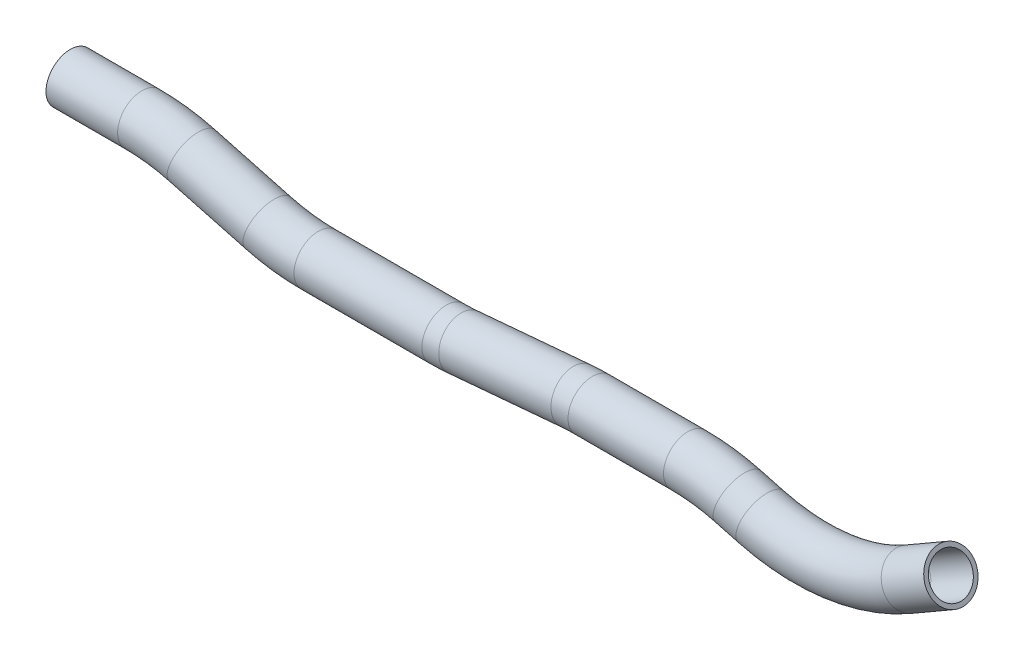
ISO-10303-21;
HEADER;
FILE_DESCRIPTION(('STEP AP214'),'2;1');
FILE_NAME('part.step','',(''),(''),'','','');
FILE_SCHEMA(('AUTOMOTIVE_DESIGN { 1 0 10303 214 1 1 1 1 }'));
ENDSEC;
DATA;
#1=APPLICATION_CONTEXT('core data for automotive mechanical design processes');
#2=APPLICATION_PROTOCOL_DEFINITION('international standard','automotive_design',2000,#1);
#3=PRODUCT_CONTEXT('',#1,'mechanical');
#4=PRODUCT('Part','Part','',(#3));
#5=PRODUCT_RELATED_PRODUCT_CATEGORY('part','',(#4));
#6=PRODUCT_DEFINITION_FORMATION('','',#4);
#7=PRODUCT_DEFINITION_CONTEXT('part definition',#1,'design');
#8=PRODUCT_DEFINITION('design','',#6,#7);
#9=PRODUCT_DEFINITION_SHAPE('','',#8);
#10=(LENGTH_UNIT() NAMED_UNIT(*) SI_UNIT(.MILLI.,.METRE.));
#11=(NAMED_UNIT(*) PLANE_ANGLE_UNIT() SI_UNIT($,.RADIAN.));
#12=(NAMED_UNIT(*) SI_UNIT($,.STERADIAN.) SOLID_ANGLE_UNIT());
#13=UNCERTAINTY_MEASURE_WITH_UNIT(LENGTH_MEASURE(1.E-05),#10,'distance_accuracy_value','');
#14=(GEOMETRIC_REPRESENTATION_CONTEXT(3) GLOBAL_UNCERTAINTY_ASSIGNED_CONTEXT((#13)) GLOBAL_UNIT_ASSIGNED_CONTEXT((#10,
#11,#12)) REPRESENTATION_CONTEXT('',''));
#15=CARTESIAN_POINT('',(0.,0.,0.));
#16=DIRECTION('',(0.,0.,1.));
#17=DIRECTION('',(1.,0.,0.));
#18=AXIS2_PLACEMENT_3D('',#15,#16,#17);
#19=CARTESIAN_POINT('',(124.181687084773,-15.9493236059186,0.));
#20=DIRECTION('',(1.,0.,0.));
#21=DIRECTION('',(0.,1.,0.));
#22=AXIS2_PLACEMENT_3D('',#19,#20,#21);
#23=CYLINDRICAL_SURFACE('',#22,9.525);
#24=CARTESIAN_POINT('',(152.249766768613,-15.9493236059186,0.));
#25=DIRECTION('',(1.,0.,0.));
#26=DIRECTION('',(0.,1.,0.));
#27=AXIS2_PLACEMENT_3D('',#24,#25,#26);
#28=CIRCLE('',#27,9.525);
#29=CARTESIAN_POINT('',(152.249766768613,-6.4243236059186,0.));
#30=VERTEX_POINT('',#29);
#31=EDGE_CURVE('E65',#30,#30,#28,.T.);
#32=ORIENTED_EDGE('',*,*,#31,.F.);
#33=EDGE_LOOP('',(#32));
#34=FACE_BOUND('',#33,.T.);
#35=CARTESIAN_POINT('',(124.181687084773,-15.9493236059186,0.));
#36=DIRECTION('',(1.,0.,0.));
#37=DIRECTION('',(0.,1.,0.));
#38=AXIS2_PLACEMENT_3D('',#35,#36,#37);
#39=CIRCLE('',#38,9.525);
#40=CARTESIAN_POINT('',(124.181687084773,-6.42432360591861,0.));
#41=VERTEX_POINT('',#40);
#42=EDGE_CURVE('E61',#41,#41,#39,.T.);
#43=ORIENTED_EDGE('',*,*,#42,.T.);
#44=EDGE_LOOP('',(#43));
#45=FACE_BOUND('',#44,.T.);
#46=ADVANCED_FACE('F37',(#34,#45),#23,.T.);
#47=CARTESIAN_POINT('',(152.249766768613,-92.1493236059186,0.));
#48=DIRECTION('',(0.,0.,-1.));
#49=DIRECTION('',(-1.,0.,0.));
#50=AXIS2_PLACEMENT_3D('',#47,#48,#49);
#51=TOROIDAL_SURFACE('',#50,76.2,9.525);
#52=CARTESIAN_POINT('',(171.971778005425,-18.5457756426916,0.));
#53=DIRECTION('',(0.965925826289068,-0.258819045102521,0.));
#54=DIRECTION('',(0.258819045102521,0.965925826289068,0.));
#55=AXIS2_PLACEMENT_3D('',#52,#53,#54);
#56=CIRCLE('',#55,9.525);
#57=CARTESIAN_POINT('',(174.437029410027,-9.34533214728822,0.));
#58=VERTEX_POINT('',#57);
#59=EDGE_CURVE('E69',#58,#58,#56,.T.);
#60=CARTESIAN_POINT('',(152.249766768613,-92.1493236059186,0.));
#61=DIRECTION('',(0.,0.,-1.));
#62=DIRECTION('',(-1.,0.,0.));
#63=AXIS2_PLACEMENT_3D('',#60,#61,#62);
#64=CIRCLE('',#63,85.725);
#65=EDGE_CURVE('',#30,#58,#64,.T.);
#66=ORIENTED_EDGE('',*,*,#31,.T.);
#67=ORIENTED_EDGE('',*,*,#59,.F.);
#68=ORIENTED_EDGE('',*,*,#65,.T.);
#69=ORIENTED_EDGE('',*,*,#65,.F.);
#70=EDGE_LOOP('',(#66,#68,#67,#69));
#71=FACE_BOUND('',#70,.T.);
#72=ADVANCED_FACE('F149',(#71),#51,.T.);
#73=CARTESIAN_POINT('',(171.971778005425,-18.5457756426916,0.));
#74=DIRECTION('',(0.965925826289068,-0.258819045102521,0.));
#75=DIRECTION('',(0.258819045102521,0.965925826289068,0.));
#76=AXIS2_PLACEMENT_3D('',#73,#74,#75);
#77=CYLINDRICAL_SURFACE('',#76,9.525);
#78=CARTESIAN_POINT('',(201.660628139605,-26.5008790603537,0.));
#79=DIRECTION('',(0.965925826289068,-0.258819045102521,0.));
#80=DIRECTION('',(0.258819045102521,0.965925826289068,0.));
#81=AXIS2_PLACEMENT_3D('',#78,#79,#80);
#82=CIRCLE('',#81,9.525);
#83=CARTESIAN_POINT('',(199.195376735003,-35.7013225557571,0.));
#84=VERTEX_POINT('',#83);
#85=EDGE_CURVE('E73',#84,#84,#82,.T.);
#86=ORIENTED_EDGE('',*,*,#85,.F.);
#87=EDGE_LOOP('',(#86));
#88=FACE_BOUND('',#87,.T.);
#89=ORIENTED_EDGE('',*,*,#59,.T.);
#90=EDGE_LOOP('',(#89));
#91=FACE_BOUND('',#90,.T.);
#92=ADVANCED_FACE('F153',(#88,#91),#77,.T.);
#93=CARTESIAN_POINT('',(221.382639376417,47.1026689028733,0.));
#94=DIRECTION('',(0.,0.,1.));
#95=DIRECTION('',(1.,0.,0.));
#96=AXIS2_PLACEMENT_3D('',#93,#94,#95);
#97=TOROIDAL_SURFACE('',#96,76.2,9.525);
#98=CARTESIAN_POINT('',(221.382639376417,-29.0973310971267,0.));
#99=DIRECTION('',(1.,0.,0.));
#100=DIRECTION('',(0.,1.,0.));
#101=AXIS2_PLACEMENT_3D('',#98,#99,#100);
#102=CIRCLE('',#101,9.525);
#103=CARTESIAN_POINT('',(221.382639376417,-38.6223310971267,0.));
#104=VERTEX_POINT('',#103);
#105=EDGE_CURVE('E77',#104,#104,#102,.T.);
#106=CARTESIAN_POINT('',(221.382639376417,47.1026689028733,0.));
#107=DIRECTION('',(0.,0.,1.));
#108=DIRECTION('',(1.,0.,0.));
#109=AXIS2_PLACEMENT_3D('',#106,#107,#108);
#110=CIRCLE('',#109,85.725);
#111=EDGE_CURVE('',#84,#104,#110,.T.);
#112=ORIENTED_EDGE('',*,*,#85,.T.);
#113=ORIENTED_EDGE('',*,*,#105,.F.);
#114=ORIENTED_EDGE('',*,*,#111,.T.);
#115=ORIENTED_EDGE('',*,*,#111,.F.);
#116=EDGE_LOOP('',(#112,#114,#113,#115));
#117=FACE_BOUND('',#116,.T.);
#118=ADVANCED_FACE('F157',(#117),#97,.T.);
#119=CARTESIAN_POINT('',(221.382639376417,-29.0973310971265,0.));
#120=DIRECTION('',(1.,0.,0.));
#121=DIRECTION('',(0.,1.,0.));
#122=AXIS2_PLACEMENT_3D('',#119,#120,#121);
#123=CYLINDRICAL_SURFACE('',#122,9.525);
#124=CARTESIAN_POINT('',(271.523755210629,-29.0973310971266,0.));
#125=DIRECTION('',(1.,0.,0.));
#126=DIRECTION('',(0.,1.,0.));
#127=AXIS2_PLACEMENT_3D('',#124,#125,#126);
#128=CIRCLE('',#127,9.525);
#129=CARTESIAN_POINT('',(271.523755210629,-38.6223310971268,0.));
#130=VERTEX_POINT('',#129);
#131=EDGE_CURVE('E81',#130,#130,#128,.T.);
#132=ORIENTED_EDGE('',*,*,#131,.F.);
#133=EDGE_LOOP('',(#132));
#134=FACE_BOUND('',#133,.T.);
#135=ORIENTED_EDGE('',*,*,#105,.T.);
#136=EDGE_LOOP('',(#135));
#137=FACE_BOUND('',#136,.T.);
#138=ADVANCED_FACE('F161',(#134,#137),#123,.T.);
#139=CARTESIAN_POINT('',(271.523755210629,47.1026689028733,0.));
#140=DIRECTION('',(0.,0.,1.));
#141=DIRECTION('',(1.,0.,0.));
#142=AXIS2_PLACEMENT_3D('',#139,#140,#141);
#143=TOROIDAL_SURFACE('',#142,76.2000000000001,9.525);
#144=CARTESIAN_POINT('',(278.165022808,-28.8073670917177,0.));
#145=DIRECTION('',(0.996194698091745,0.0871557427476593,0.));
#146=DIRECTION('',(-0.0871557427476593,0.996194698091745,0.));
#147=AXIS2_PLACEMENT_3D('',#144,#145,#146);
#148=CIRCLE('',#147,9.525);
#149=CARTESIAN_POINT('',(278.995181257672,-38.2961215910417,0.));
#150=VERTEX_POINT('',#149);
#151=EDGE_CURVE('E85',#150,#150,#148,.T.);
#152=CARTESIAN_POINT('',(271.523755210629,47.1026689028733,0.));
#153=DIRECTION('',(0.,0.,1.));
#154=DIRECTION('',(1.,0.,0.));
#155=AXIS2_PLACEMENT_3D('',#152,#153,#154);
#156=CIRCLE('',#155,85.7250000000001);
#157=EDGE_CURVE('',#130,#150,#156,.T.);
#158=ORIENTED_EDGE('',*,*,#131,.T.);
#159=ORIENTED_EDGE('',*,*,#151,.F.);
#160=ORIENTED_EDGE('',*,*,#157,.T.);
#161=ORIENTED_EDGE('',*,*,#157,.F.);
#162=EDGE_LOOP('',(#158,#160,#159,#161));
#163=FACE_BOUND('',#162,.T.);
#164=ADVANCED_FACE('F165',(#163),#143,.T.);
#165=CARTESIAN_POINT('',(278.165022808,-28.8073670917177,0.));
#166=DIRECTION('',(0.996194698091745,0.0871557427476594,0.));
#167=DIRECTION('',(-0.0871557427476594,0.996194698091746,0.));
#168=AXIS2_PLACEMENT_3D('',#165,#166,#167);
#169=CYLINDRICAL_SURFACE('',#168,9.525);
#170=CARTESIAN_POINT('',(322.143105975575,-24.9597833709546,0.));
#171=DIRECTION('',(0.996194698091745,0.0871557427476592,0.));
#172=DIRECTION('',(-0.0871557427476592,0.996194698091745,0.));
#173=AXIS2_PLACEMENT_3D('',#170,#171,#172);
#174=CIRCLE('',#173,9.525);
#175=CARTESIAN_POINT('',(321.312947525904,-15.4710288716307,0.));
#176=VERTEX_POINT('',#175);
#177=EDGE_CURVE('E89',#176,#176,#174,.T.);
#178=ORIENTED_EDGE('',*,*,#177,.F.);
#179=EDGE_LOOP('',(#178));
#180=FACE_BOUND('',#179,.T.);
#181=ORIENTED_EDGE('',*,*,#151,.T.);
#182=EDGE_LOOP('',(#181));
#183=FACE_BOUND('',#182,.T.);
#184=ADVANCED_FACE('F169',(#180,#183),#169,.T.);
#185=CARTESIAN_POINT('',(328.784373572947,-100.869819365546,0.));
#186=DIRECTION('',(0.,0.,-1.));
#187=DIRECTION('',(-1.,0.,0.));
#188=AXIS2_PLACEMENT_3D('',#185,#186,#187);
#189=TOROIDAL_SURFACE('',#188,76.2,9.525);
#190=CARTESIAN_POINT('',(328.784373572947,-24.6698193655458,0.));
#191=DIRECTION('',(1.,0.,0.));
#192=DIRECTION('',(0.,1.,0.));
#193=AXIS2_PLACEMENT_3D('',#190,#191,#192);
#194=CIRCLE('',#193,9.525);
#195=CARTESIAN_POINT('',(328.784373572947,-15.1448193655456,0.));
#196=VERTEX_POINT('',#195);
#197=EDGE_CURVE('E93',#196,#196,#194,.T.);
#198=CARTESIAN_POINT('',(328.784373572947,-100.869819365546,0.));
#199=DIRECTION('',(0.,0.,-1.));
#200=DIRECTION('',(-1.,0.,0.));
#201=AXIS2_PLACEMENT_3D('',#198,#199,#200);
#202=CIRCLE('',#201,85.725);
#203=EDGE_CURVE('',#176,#196,#202,.T.);
#204=ORIENTED_EDGE('',*,*,#177,.T.);
#205=ORIENTED_EDGE('',*,*,#197,.F.);
#206=ORIENTED_EDGE('',*,*,#203,.T.);
#207=ORIENTED_EDGE('',*,*,#203,.F.);
#208=EDGE_LOOP('',(#204,#206,#205,#207));
#209=FACE_BOUND('',#208,.T.);
#210=ADVANCED_FACE('F173',(#209),#189,.T.);
#211=CARTESIAN_POINT('',(328.784373572947,-24.6698193655458,0.));
#212=DIRECTION('',(1.,0.,0.));
#213=DIRECTION('',(0.,1.,0.));
#214=AXIS2_PLACEMENT_3D('',#211,#212,#213);
#215=CYLINDRICAL_SURFACE('',#214,9.525);
#216=CARTESIAN_POINT('',(366.225489407159,-24.6698193655457,0.));
#217=DIRECTION('',(1.,0.,0.));
#218=DIRECTION('',(0.,1.,0.));
#219=AXIS2_PLACEMENT_3D('',#216,#217,#218);
#220=CIRCLE('',#219,9.525);
#221=CARTESIAN_POINT('',(366.225489407159,-15.1448193655452,0.));
#222=VERTEX_POINT('',#221);
#223=EDGE_CURVE('E97',#222,#222,#220,.T.);
#224=ORIENTED_EDGE('',*,*,#223,.F.);
#225=EDGE_LOOP('',(#224));
#226=FACE_BOUND('',#225,.T.);
#227=ORIENTED_EDGE('',*,*,#197,.T.);
#228=EDGE_LOOP('',(#227));
#229=FACE_BOUND('',#228,.T.);
#230=ADVANCED_FACE('F177',(#226,#229),#215,.T.);
#231=CARTESIAN_POINT('',(366.225489407159,-100.869819365545,0.));
#232=DIRECTION('',(0.,0.,-1.));
#233=DIRECTION('',(-1.,0.,0.));
#234=AXIS2_PLACEMENT_3D('',#231,#232,#233);
#235=TOROIDAL_SURFACE('',#234,76.2000000000001,9.525);
#236=CARTESIAN_POINT('',(385.947500643971,-27.2662714023186,0.));
#237=DIRECTION('',(0.965925826289067,-0.258819045102524,0.));
#238=DIRECTION('',(0.258819045102524,0.965925826289068,0.));
#239=AXIS2_PLACEMENT_3D('',#236,#237,#238);
#240=CIRCLE('',#239,9.525);
#241=CARTESIAN_POINT('',(388.412752048572,-18.0658279069149,0.));
#242=VERTEX_POINT('',#241);
#243=EDGE_CURVE('E101',#242,#242,#240,.T.);
#244=CARTESIAN_POINT('',(366.225489407159,-100.869819365545,0.));
#245=DIRECTION('',(0.,0.,-1.));
#246=DIRECTION('',(-1.,0.,0.));
#247=AXIS2_PLACEMENT_3D('',#244,#245,#246);
#248=CIRCLE('',#247,85.7250000000002);
#249=EDGE_CURVE('',#222,#242,#248,.T.);
#250=ORIENTED_EDGE('',*,*,#223,.T.);
#251=ORIENTED_EDGE('',*,*,#243,.F.);
#252=ORIENTED_EDGE('',*,*,#249,.T.);
#253=ORIENTED_EDGE('',*,*,#249,.F.);
#254=EDGE_LOOP('',(#250,#252,#251,#253));
#255=FACE_BOUND('',#254,.T.);
#256=ADVANCED_FACE('F123',(#255),#235,.T.);
#257=CARTESIAN_POINT('',(385.947500643971,-27.2662714023185,0.));
#258=DIRECTION('',(0.965925826289067,-0.258819045102527,0.));
#259=DIRECTION('',(0.258819045102527,0.965925826289067,0.));
#260=AXIS2_PLACEMENT_3D('',#257,#258,#259);
#261=CYLINDRICAL_SURFACE('',#260,9.525);
#262=CARTESIAN_POINT('',(394.838853893655,-29.6487023251914,0.));
#263=DIRECTION('',(0.965925826289067,-0.258819045102527,0.));
#264=DIRECTION('',(0.258819045102527,0.965925826289067,0.));
#265=AXIS2_PLACEMENT_3D('',#262,#263,#264);
#266=CIRCLE('',#265,9.525);
#267=CARTESIAN_POINT('',(392.373602489054,-38.8491458205948,0.));
#268=VERTEX_POINT('',#267);
#269=EDGE_CURVE('E104',#268,#268,#266,.T.);
#270=ORIENTED_EDGE('',*,*,#269,.F.);
#271=EDGE_LOOP('',(#270));
#272=FACE_BOUND('',#271,.T.);
#273=ORIENTED_EDGE('',*,*,#243,.T.);
#274=EDGE_LOOP('',(#273));
#275=FACE_BOUND('',#274,.T.);
#276=ADVANCED_FACE('F116',(#272,#275),#261,.T.);
#277=CARTESIAN_POINT('',(414.560865130467,43.9548456380357,0.));
#278=DIRECTION('',(0.,0.,1.));
#279=DIRECTION('',(1.,0.,0.));
#280=AXIS2_PLACEMENT_3D('',#277,#278,#279);
#281=TOROIDAL_SURFACE('',#280,76.2000000000001,9.525);
#282=CARTESIAN_POINT('',(452.660865130468,-22.0362901303385,0.));
#283=DIRECTION('',(0.866025403784437,0.500000000000002,0.));
#284=DIRECTION('',(-0.500000000000002,0.866025403784437,0.));
#285=AXIS2_PLACEMENT_3D('',#282,#283,#284);
#286=CIRCLE('',#285,9.525);
#287=CARTESIAN_POINT('',(457.423365130468,-30.2851821013852,0.));
#288=VERTEX_POINT('',#287);
#289=EDGE_CURVE('E41',#288,#288,#286,.T.);
#290=CARTESIAN_POINT('',(414.560865130467,43.9548456380357,0.));
#291=DIRECTION('',(0.,0.,1.));
#292=DIRECTION('',(1.,0.,0.));
#293=AXIS2_PLACEMENT_3D('',#290,#291,#292);
#294=CIRCLE('',#293,85.7250000000001);
#295=EDGE_CURVE('',#268,#288,#294,.T.);
#296=ORIENTED_EDGE('',*,*,#269,.T.);
#297=ORIENTED_EDGE('',*,*,#289,.F.);
#298=ORIENTED_EDGE('',*,*,#295,.T.);
#299=ORIENTED_EDGE('',*,*,#295,.F.);
#300=EDGE_LOOP('',(#296,#298,#297,#299));
#301=FACE_BOUND('',#300,.T.);
#302=ADVANCED_FACE('F114',(#301),#281,.T.);
#303=CARTESIAN_POINT('',(452.660865130468,-22.0362901303384,0.));
#304=DIRECTION('',(0.866025403784437,0.500000000000003,0.));
#305=DIRECTION('',(-0.500000000000003,0.866025403784437,0.));
#306=AXIS2_PLACEMENT_3D('',#303,#304,#305);
#307=CYLINDRICAL_SURFACE('',#306,9.525);
#308=CARTESIAN_POINT('',(469.320532211052,-12.4178268567534,0.));
#309=DIRECTION('',(0.866025403784437,0.500000000000002,0.));
#310=DIRECTION('',(-0.500000000000002,0.866025403784437,0.));
#311=AXIS2_PLACEMENT_3D('',#308,#309,#310);
#312=CIRCLE('',#311,9.525);
#313=CARTESIAN_POINT('',(464.558032211052,-4.16893488570662,0.));
#314=VERTEX_POINT('',#313);
#315=EDGE_CURVE('E56',#314,#314,#312,.T.);
#316=ORIENTED_EDGE('',*,*,#315,.F.);
#317=EDGE_LOOP('',(#316));
#318=FACE_BOUND('',#317,.T.);
#319=ORIENTED_EDGE('',*,*,#289,.T.);
#320=EDGE_LOOP('',(#319));
#321=FACE_BOUND('',#320,.T.);
#322=ADVANCED_FACE('F39',(#318,#321),#307,.T.);
#323=CARTESIAN_POINT('',(124.181687084773,-15.9493236059186,0.));
#324=DIRECTION('',(1.,0.,0.));
#325=DIRECTION('',(0.,1.,0.));
#326=AXIS2_PLACEMENT_3D('',#323,#324,#325);
#327=PLANE('',#326);
#328=CARTESIAN_POINT('',(124.181687084773,-15.9493236059186,0.));
#329=DIRECTION('',(1.,0.,0.));
#330=DIRECTION('',(0.,1.,0.));
#331=AXIS2_PLACEMENT_3D('',#328,#329,#330);
#332=CIRCLE('',#331,7.874);
#333=CARTESIAN_POINT('',(124.181687084773,-8.07532360591861,0.));
#334=VERTEX_POINT('',#333);
#335=EDGE_CURVE('E60',#334,#334,#332,.F.);
#336=ORIENTED_EDGE('',*,*,#335,.F.);
#337=EDGE_LOOP('',(#336));
#338=FACE_BOUND('',#337,.T.);
#339=ORIENTED_EDGE('',*,*,#42,.F.);
#340=EDGE_LOOP('',(#339));
#341=FACE_BOUND('',#340,.T.);
#342=ADVANCED_FACE('F121',(#338,#341),#327,.F.);
#343=CARTESIAN_POINT('',(469.320532211052,-12.4178268567534,0.));
#344=DIRECTION('',(0.866025403784437,0.500000000000002,0.));
#345=DIRECTION('',(-0.500000000000002,0.866025403784437,0.));
#346=AXIS2_PLACEMENT_3D('',#343,#344,#345);
#347=PLANE('',#346);
#348=CARTESIAN_POINT('',(469.320532211052,-12.4178268567534,0.));
#349=DIRECTION('',(0.866025403784437,0.500000000000002,0.));
#350=DIRECTION('',(-0.500000000000002,0.866025403784437,0.));
#351=AXIS2_PLACEMENT_3D('',#348,#349,#350);
#352=CIRCLE('',#351,7.874);
#353=CARTESIAN_POINT('',(465.383532211052,-5.59874282735473,0.));
#354=VERTEX_POINT('',#353);
#355=EDGE_CURVE('E10',#354,#354,#352,.F.);
#356=ORIENTED_EDGE('',*,*,#355,.T.);
#357=EDGE_LOOP('',(#356));
#358=FACE_BOUND('',#357,.T.);
#359=ORIENTED_EDGE('',*,*,#315,.T.);
#360=EDGE_LOOP('',(#359));
#361=FACE_BOUND('',#360,.T.);
#362=ADVANCED_FACE('F140',(#358,#361),#347,.T.);
#363=CARTESIAN_POINT('',(124.181687084773,-15.9493236059186,0.));
#364=DIRECTION('',(1.,0.,0.));
#365=DIRECTION('',(0.,1.,0.));
#366=AXIS2_PLACEMENT_3D('',#363,#364,#365);
#367=CYLINDRICAL_SURFACE('',#366,7.874);
#368=CARTESIAN_POINT('',(152.249766768613,-15.9493236059186,0.));
#369=DIRECTION('',(1.,0.,0.));
#370=DIRECTION('',(0.,1.,0.));
#371=AXIS2_PLACEMENT_3D('',#368,#369,#370);
#372=CIRCLE('',#371,7.874);
#373=CARTESIAN_POINT('',(152.249766768613,-8.07532360591862,0.));
#374=VERTEX_POINT('',#373);
#375=EDGE_CURVE('E400',#374,#374,#372,.F.);
#376=ORIENTED_EDGE('',*,*,#375,.F.);
#377=EDGE_LOOP('',(#376));
#378=FACE_BOUND('',#377,.T.);
#379=ORIENTED_EDGE('',*,*,#335,.T.);
#380=EDGE_LOOP('',(#379));
#381=FACE_BOUND('',#380,.T.);
#382=ADVANCED_FACE('F143',(#378,#381),#367,.F.);
#383=CARTESIAN_POINT('',(152.249766768613,-92.1493236059186,0.));
#384=DIRECTION('',(0.,0.,-1.));
#385=DIRECTION('',(-1.,0.,0.));
#386=AXIS2_PLACEMENT_3D('',#383,#384,#385);
#387=TOROIDAL_SURFACE('',#386,76.2,7.874);
#388=CARTESIAN_POINT('',(171.971778005425,-18.5457756426916,0.));
#389=DIRECTION('',(0.965925826289068,-0.258819045102521,0.));
#390=DIRECTION('',(0.258819045102521,0.965925826289068,0.));
#391=AXIS2_PLACEMENT_3D('',#388,#389,#390);
#392=CIRCLE('',#391,7.874);
#393=CARTESIAN_POINT('',(174.009719166562,-10.9400756864915,0.));
#394=VERTEX_POINT('',#393);
#395=EDGE_CURVE('E396',#394,#394,#392,.F.);
#396=CARTESIAN_POINT('',(152.249766768613,-92.1493236059186,0.));
#397=DIRECTION('',(0.,0.,-1.));
#398=DIRECTION('',(-1.,0.,0.));
#399=AXIS2_PLACEMENT_3D('',#396,#397,#398);
#400=CIRCLE('',#399,84.074);
#401=EDGE_CURVE('',#374,#394,#400,.T.);
#402=ORIENTED_EDGE('',*,*,#375,.T.);
#403=ORIENTED_EDGE('',*,*,#395,.F.);
#404=ORIENTED_EDGE('',*,*,#401,.T.);
#405=ORIENTED_EDGE('',*,*,#401,.F.);
#406=EDGE_LOOP('',(#402,#404,#403,#405));
#407=FACE_BOUND('',#406,.T.);
#408=ADVANCED_FACE('F246',(#407),#387,.F.);
#409=CARTESIAN_POINT('',(171.971778005425,-18.5457756426916,0.));
#410=DIRECTION('',(0.965925826289068,-0.258819045102521,0.));
#411=DIRECTION('',(0.258819045102521,0.965925826289068,0.));
#412=AXIS2_PLACEMENT_3D('',#409,#410,#411);
#413=CYLINDRICAL_SURFACE('',#412,7.874);
#414=CARTESIAN_POINT('',(201.660628139605,-26.5008790603537,0.));
#415=DIRECTION('',(0.965925826289068,-0.258819045102521,0.));
#416=DIRECTION('',(0.258819045102521,0.965925826289068,0.));
#417=AXIS2_PLACEMENT_3D('',#414,#415,#416);
#418=CIRCLE('',#417,7.874);
#419=CARTESIAN_POINT('',(199.622686978468,-34.1065790165538,0.));
#420=VERTEX_POINT('',#419);
#421=EDGE_CURVE('E392',#420,#420,#418,.F.);
#422=ORIENTED_EDGE('',*,*,#421,.F.);
#423=EDGE_LOOP('',(#422));
#424=FACE_BOUND('',#423,.T.);
#425=ORIENTED_EDGE('',*,*,#395,.T.);
#426=EDGE_LOOP('',(#425));
#427=FACE_BOUND('',#426,.T.);
#428=ADVANCED_FACE('F256',(#424,#427),#413,.F.);
#429=CARTESIAN_POINT('',(221.382639376417,47.1026689028733,0.));
#430=DIRECTION('',(0.,0.,1.));
#431=DIRECTION('',(1.,0.,0.));
#432=AXIS2_PLACEMENT_3D('',#429,#430,#431);
#433=TOROIDAL_SURFACE('',#432,76.2,7.874);
#434=CARTESIAN_POINT('',(221.382639376417,-29.0973310971267,0.));
#435=DIRECTION('',(1.,0.,0.));
#436=DIRECTION('',(0.,1.,0.));
#437=AXIS2_PLACEMENT_3D('',#434,#435,#436);
#438=CIRCLE('',#437,7.874);
#439=CARTESIAN_POINT('',(221.382639376417,-36.9713310971267,0.));
#440=VERTEX_POINT('',#439);
#441=EDGE_CURVE('E388',#440,#440,#438,.F.);
#442=CARTESIAN_POINT('',(221.382639376417,47.1026689028733,0.));
#443=DIRECTION('',(0.,0.,1.));
#444=DIRECTION('',(1.,0.,0.));
#445=AXIS2_PLACEMENT_3D('',#442,#443,#444);
#446=CIRCLE('',#445,84.074);
#447=EDGE_CURVE('',#420,#440,#446,.T.);
#448=ORIENTED_EDGE('',*,*,#421,.T.);
#449=ORIENTED_EDGE('',*,*,#441,.F.);
#450=ORIENTED_EDGE('',*,*,#447,.T.);
#451=ORIENTED_EDGE('',*,*,#447,.F.);
#452=EDGE_LOOP('',(#448,#450,#449,#451));
#453=FACE_BOUND('',#452,.T.);
#454=ADVANCED_FACE('F266',(#453),#433,.F.);
#455=CARTESIAN_POINT('',(221.382639376417,-29.0973310971265,0.));
#456=DIRECTION('',(1.,0.,0.));
#457=DIRECTION('',(0.,1.,0.));
#458=AXIS2_PLACEMENT_3D('',#455,#456,#457);
#459=CYLINDRICAL_SURFACE('',#458,7.874);
#460=CARTESIAN_POINT('',(271.523755210629,-29.0973310971266,0.));
#461=DIRECTION('',(1.,0.,0.));
#462=DIRECTION('',(0.,1.,0.));
#463=AXIS2_PLACEMENT_3D('',#460,#461,#462);
#464=CIRCLE('',#463,7.874);
#465=CARTESIAN_POINT('',(271.523755210629,-36.9713310971268,0.));
#466=VERTEX_POINT('',#465);
#467=EDGE_CURVE('E384',#466,#466,#464,.F.);
#468=ORIENTED_EDGE('',*,*,#467,.F.);
#469=EDGE_LOOP('',(#468));
#470=FACE_BOUND('',#469,.T.);
#471=ORIENTED_EDGE('',*,*,#441,.T.);
#472=EDGE_LOOP('',(#471));
#473=FACE_BOUND('',#472,.T.);
#474=ADVANCED_FACE('F276',(#470,#473),#459,.F.);
#475=CARTESIAN_POINT('',(271.523755210629,47.1026689028733,0.));
#476=DIRECTION('',(0.,0.,1.));
#477=DIRECTION('',(1.,0.,0.));
#478=AXIS2_PLACEMENT_3D('',#475,#476,#477);
#479=TOROIDAL_SURFACE('',#478,76.2000000000001,7.874);
#480=CARTESIAN_POINT('',(278.165022808,-28.8073670917177,0.));
#481=DIRECTION('',(0.996194698091745,0.0871557427476593,0.));
#482=DIRECTION('',(-0.0871557427476593,0.996194698091745,0.));
#483=AXIS2_PLACEMENT_3D('',#480,#481,#482);
#484=CIRCLE('',#483,7.874);
#485=CARTESIAN_POINT('',(278.851287126395,-36.6514041444922,0.));
#486=VERTEX_POINT('',#485);
#487=EDGE_CURVE('E380',#486,#486,#484,.F.);
#488=CARTESIAN_POINT('',(271.523755210629,47.1026689028733,0.));
#489=DIRECTION('',(0.,0.,1.));
#490=DIRECTION('',(1.,0.,0.));
#491=AXIS2_PLACEMENT_3D('',#488,#489,#490);
#492=CIRCLE('',#491,84.0740000000001);
#493=EDGE_CURVE('',#466,#486,#492,.T.);
#494=ORIENTED_EDGE('',*,*,#467,.T.);
#495=ORIENTED_EDGE('',*,*,#487,.F.);
#496=ORIENTED_EDGE('',*,*,#493,.T.);
#497=ORIENTED_EDGE('',*,*,#493,.F.);
#498=EDGE_LOOP('',(#494,#496,#495,#497));
#499=FACE_BOUND('',#498,.T.);
#500=ADVANCED_FACE('F286',(#499),#479,.F.);
#501=CARTESIAN_POINT('',(278.165022808,-28.8073670917177,0.));
#502=DIRECTION('',(0.996194698091745,0.0871557427476594,0.));
#503=DIRECTION('',(-0.0871557427476594,0.996194698091746,0.));
#504=AXIS2_PLACEMENT_3D('',#501,#502,#503);
#505=CYLINDRICAL_SURFACE('',#504,7.874);
#506=CARTESIAN_POINT('',(322.143105975575,-24.9597833709546,0.));
#507=DIRECTION('',(0.996194698091745,0.0871557427476592,0.));
#508=DIRECTION('',(-0.0871557427476592,0.996194698091745,0.));
#509=AXIS2_PLACEMENT_3D('',#506,#507,#508);
#510=CIRCLE('',#509,7.874);
#511=CARTESIAN_POINT('',(321.45684165718,-17.1157463181802,0.));
#512=VERTEX_POINT('',#511);
#513=EDGE_CURVE('E376',#512,#512,#510,.F.);
#514=ORIENTED_EDGE('',*,*,#513,.F.);
#515=EDGE_LOOP('',(#514));
#516=FACE_BOUND('',#515,.T.);
#517=ORIENTED_EDGE('',*,*,#487,.T.);
#518=EDGE_LOOP('',(#517));
#519=FACE_BOUND('',#518,.T.);
#520=ADVANCED_FACE('F296',(#516,#519),#505,.F.);
#521=CARTESIAN_POINT('',(328.784373572947,-100.869819365546,0.));
#522=DIRECTION('',(0.,0.,-1.));
#523=DIRECTION('',(-1.,0.,0.));
#524=AXIS2_PLACEMENT_3D('',#521,#522,#523);
#525=TOROIDAL_SURFACE('',#524,76.2,7.874);
#526=CARTESIAN_POINT('',(328.784373572947,-24.6698193655458,0.));
#527=DIRECTION('',(1.,0.,0.));
#528=DIRECTION('',(0.,1.,0.));
#529=AXIS2_PLACEMENT_3D('',#526,#527,#528);
#530=CIRCLE('',#529,7.874);
#531=CARTESIAN_POINT('',(328.784373572947,-16.7958193655456,0.));
#532=VERTEX_POINT('',#531);
#533=EDGE_CURVE('E370',#532,#532,#530,.F.);
#534=CARTESIAN_POINT('',(328.784373572947,-100.869819365546,0.));
#535=DIRECTION('',(0.,0.,-1.));
#536=DIRECTION('',(-1.,0.,0.));
#537=AXIS2_PLACEMENT_3D('',#534,#535,#536);
#538=CIRCLE('',#537,84.074);
#539=EDGE_CURVE('',#512,#532,#538,.T.);
#540=ORIENTED_EDGE('',*,*,#513,.T.);
#541=ORIENTED_EDGE('',*,*,#533,.F.);
#542=ORIENTED_EDGE('',*,*,#539,.T.);
#543=ORIENTED_EDGE('',*,*,#539,.F.);
#544=EDGE_LOOP('',(#540,#542,#541,#543));
#545=FACE_BOUND('',#544,.T.);
#546=ADVANCED_FACE('F306',(#545),#525,.F.);
#547=CARTESIAN_POINT('',(328.784373572947,-24.6698193655458,0.));
#548=DIRECTION('',(1.,0.,0.));
#549=DIRECTION('',(0.,1.,0.));
#550=AXIS2_PLACEMENT_3D('',#547,#548,#549);
#551=CYLINDRICAL_SURFACE('',#550,7.874);
#552=CARTESIAN_POINT('',(366.225489407159,-24.6698193655457,0.));
#553=DIRECTION('',(1.,0.,0.));
#554=DIRECTION('',(0.,1.,0.));
#555=AXIS2_PLACEMENT_3D('',#552,#553,#554);
#556=CIRCLE('',#555,7.874);
#557=CARTESIAN_POINT('',(366.225489407159,-16.7958193655452,0.));
#558=VERTEX_POINT('',#557);
#559=EDGE_CURVE('E365',#558,#558,#556,.F.);
#560=ORIENTED_EDGE('',*,*,#559,.F.);
#561=EDGE_LOOP('',(#560));
#562=FACE_BOUND('',#561,.T.);
#563=ORIENTED_EDGE('',*,*,#533,.T.);
#564=EDGE_LOOP('',(#563));
#565=FACE_BOUND('',#564,.T.);
#566=ADVANCED_FACE('F316',(#562,#565),#551,.F.);
#567=CARTESIAN_POINT('',(366.225489407159,-100.869819365545,0.));
#568=DIRECTION('',(0.,0.,-1.));
#569=DIRECTION('',(-1.,0.,0.));
#570=AXIS2_PLACEMENT_3D('',#567,#568,#569);
#571=TOROIDAL_SURFACE('',#570,76.2000000000001,7.874);
#572=CARTESIAN_POINT('',(385.947500643971,-27.2662714023186,0.));
#573=DIRECTION('',(0.965925826289067,-0.258819045102524,0.));
#574=DIRECTION('',(0.258819045102524,0.965925826289068,0.));
#575=AXIS2_PLACEMENT_3D('',#572,#573,#574);
#576=CIRCLE('',#575,7.874);
#577=CARTESIAN_POINT('',(387.985441805108,-19.6605714461182,0.));
#578=VERTEX_POINT('',#577);
#579=EDGE_CURVE('E363',#578,#578,#576,.F.);
#580=CARTESIAN_POINT('',(366.225489407159,-100.869819365545,0.));
#581=DIRECTION('',(0.,0.,-1.));
#582=DIRECTION('',(-1.,0.,0.));
#583=AXIS2_PLACEMENT_3D('',#580,#581,#582);
#584=CIRCLE('',#583,84.0740000000001);
#585=EDGE_CURVE('',#558,#578,#584,.T.);
#586=ORIENTED_EDGE('',*,*,#559,.T.);
#587=ORIENTED_EDGE('',*,*,#579,.F.);
#588=ORIENTED_EDGE('',*,*,#585,.T.);
#589=ORIENTED_EDGE('',*,*,#585,.F.);
#590=EDGE_LOOP('',(#586,#588,#587,#589));
#591=FACE_BOUND('',#590,.T.);
#592=ADVANCED_FACE('F326',(#591),#571,.F.);
#593=CARTESIAN_POINT('',(385.947500643971,-27.2662714023185,0.));
#594=DIRECTION('',(0.965925826289067,-0.258819045102527,0.));
#595=DIRECTION('',(0.258819045102527,0.965925826289067,0.));
#596=AXIS2_PLACEMENT_3D('',#593,#594,#595);
#597=CYLINDRICAL_SURFACE('',#596,7.874);
#598=CARTESIAN_POINT('',(394.838853893655,-29.6487023251914,0.));
#599=DIRECTION('',(0.965925826289067,-0.258819045102527,0.));
#600=DIRECTION('',(0.258819045102527,0.965925826289067,0.));
#601=AXIS2_PLACEMENT_3D('',#598,#599,#600);
#602=CIRCLE('',#601,7.874);
#603=CARTESIAN_POINT('',(392.800912732518,-37.2544022813915,0.));
#604=VERTEX_POINT('',#603);
#605=EDGE_CURVE('E52',#604,#604,#602,.F.);
#606=ORIENTED_EDGE('',*,*,#605,.F.);
#607=EDGE_LOOP('',(#606));
#608=FACE_BOUND('',#607,.T.);
#609=ORIENTED_EDGE('',*,*,#579,.T.);
#610=EDGE_LOOP('',(#609));
#611=FACE_BOUND('',#610,.T.);
#612=ADVANCED_FACE('F134',(#608,#611),#597,.F.);
#613=CARTESIAN_POINT('',(414.560865130467,43.9548456380357,0.));
#614=DIRECTION('',(0.,0.,1.));
#615=DIRECTION('',(1.,0.,0.));
#616=AXIS2_PLACEMENT_3D('',#613,#614,#615);
#617=TOROIDAL_SURFACE('',#616,76.2000000000001,7.874);
#618=CARTESIAN_POINT('',(452.660865130468,-22.0362901303385,0.));
#619=DIRECTION('',(0.866025403784437,0.500000000000002,0.));
#620=DIRECTION('',(-0.500000000000002,0.866025403784437,0.));
#621=AXIS2_PLACEMENT_3D('',#618,#619,#620);
#622=CIRCLE('',#621,7.874);
#623=CARTESIAN_POINT('',(456.597865130468,-28.8553741597371,0.));
#624=VERTEX_POINT('',#623);
#625=EDGE_CURVE('E46',#624,#624,#622,.F.);
#626=CARTESIAN_POINT('',(414.560865130467,43.9548456380357,0.));
#627=DIRECTION('',(0.,0.,1.));
#628=DIRECTION('',(1.,0.,0.));
#629=AXIS2_PLACEMENT_3D('',#626,#627,#628);
#630=CIRCLE('',#629,84.0740000000001);
#631=EDGE_CURVE('',#604,#624,#630,.T.);
#632=ORIENTED_EDGE('',*,*,#605,.T.);
#633=ORIENTED_EDGE('',*,*,#625,.F.);
#634=ORIENTED_EDGE('',*,*,#631,.T.);
#635=ORIENTED_EDGE('',*,*,#631,.F.);
#636=EDGE_LOOP('',(#632,#634,#633,#635));
#637=FACE_BOUND('',#636,.T.);
#638=ADVANCED_FACE('F128',(#637),#617,.F.);
#639=CARTESIAN_POINT('',(452.660865130468,-22.0362901303384,0.));
#640=DIRECTION('',(0.866025403784437,0.500000000000003,0.));
#641=DIRECTION('',(-0.500000000000003,0.866025403784437,0.));
#642=AXIS2_PLACEMENT_3D('',#639,#640,#641);
#643=CYLINDRICAL_SURFACE('',#642,7.874);
#644=ORIENTED_EDGE('',*,*,#355,.F.);
#645=EDGE_LOOP('',(#644));
#646=FACE_BOUND('',#645,.T.);
#647=ORIENTED_EDGE('',*,*,#625,.T.);
#648=EDGE_LOOP('',(#647));
#649=FACE_BOUND('',#648,.T.);
#650=ADVANCED_FACE('F126',(#646,#649),#643,.F.);
#651=CLOSED_SHELL('',(#46,#72,#92,#118,#138,#164,#184,#210,#230,#256,#276,#302,#322,#342,#362,
#382,#408,#428,#454,#474,#500,#520,#546,#566,#592,#612,#638,#650));
#652=MANIFOLD_SOLID_BREP('B2',#651);
#653=ADVANCED_BREP_SHAPE_REPRESENTATION('',(#18,#652),#14);
#654=SHAPE_DEFINITION_REPRESENTATION(#9,#653);
ENDSEC;
END-ISO-10303-21;
